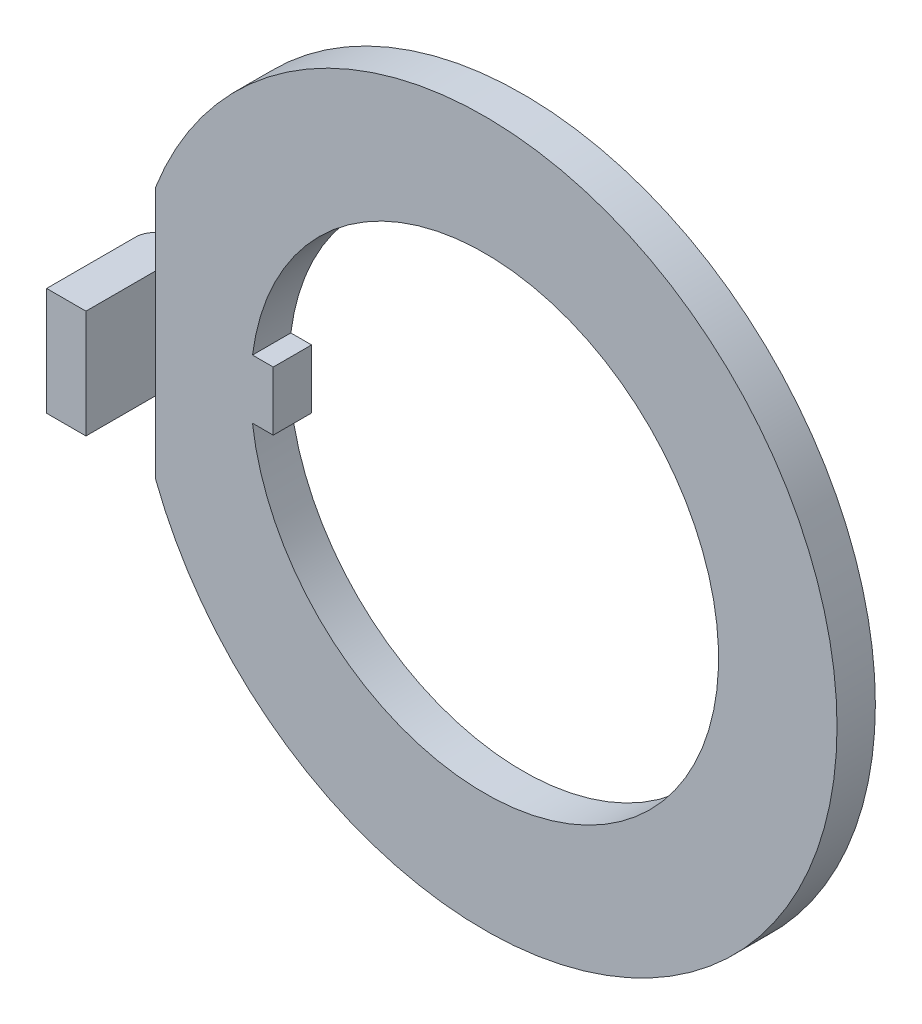
ISO-10303-21;
HEADER;
FILE_DESCRIPTION(('STEP AP214'),'2;1');
FILE_NAME('part.step','',(''),(''),'','','');
FILE_SCHEMA(('AUTOMOTIVE_DESIGN { 1 0 10303 214 1 1 1 1 }'));
ENDSEC;
DATA;
#1=APPLICATION_CONTEXT('core data for automotive mechanical design processes');
#2=APPLICATION_PROTOCOL_DEFINITION('international standard','automotive_design',2000,#1);
#3=PRODUCT_CONTEXT('',#1,'mechanical');
#4=PRODUCT('Part','Part','',(#3));
#5=PRODUCT_RELATED_PRODUCT_CATEGORY('part','',(#4));
#6=PRODUCT_DEFINITION_FORMATION('','',#4);
#7=PRODUCT_DEFINITION_CONTEXT('part definition',#1,'design');
#8=PRODUCT_DEFINITION('design','',#6,#7);
#9=PRODUCT_DEFINITION_SHAPE('','',#8);
#10=(LENGTH_UNIT() NAMED_UNIT(*) SI_UNIT(.MILLI.,.METRE.));
#11=(NAMED_UNIT(*) PLANE_ANGLE_UNIT() SI_UNIT($,.RADIAN.));
#12=(NAMED_UNIT(*) SI_UNIT($,.STERADIAN.) SOLID_ANGLE_UNIT());
#13=UNCERTAINTY_MEASURE_WITH_UNIT(LENGTH_MEASURE(1.E-05),#10,'distance_accuracy_value','');
#14=(GEOMETRIC_REPRESENTATION_CONTEXT(3) GLOBAL_UNCERTAINTY_ASSIGNED_CONTEXT((#13)) GLOBAL_UNIT_ASSIGNED_CONTEXT((#10,
#11,#12)) REPRESENTATION_CONTEXT('',''));
#15=CARTESIAN_POINT('',(0.,0.,0.));
#16=DIRECTION('',(0.,0.,1.));
#17=DIRECTION('',(1.,0.,0.));
#18=AXIS2_PLACEMENT_3D('',#15,#16,#17);
#19=CARTESIAN_POINT('',(-8.4963,3.2757138336552,0.9906));
#20=DIRECTION('',(1.,0.,0.));
#21=DIRECTION('',(0.,0.,-1.));
#22=AXIS2_PLACEMENT_3D('',#19,#20,#21);
#23=PLANE('',#22);
#24=DIRECTION('',(0.,0.,1.));
#25=VECTOR('',#24,1.);
#26=CARTESIAN_POINT('',(-8.4963,-1.397,0.9906));
#27=LINE('',#26,#25);
#28=CARTESIAN_POINT('',(-8.4963,-1.397,0.));
#29=VERTEX_POINT('',#28);
#30=CARTESIAN_POINT('',(-8.4963,-1.397,0.9906));
#31=VERTEX_POINT('',#30);
#32=EDGE_CURVE('E11',#29,#31,#27,.T.);
#33=ORIENTED_EDGE('',*,*,#32,.F.);
#34=DIRECTION('',(0.,-1.,0.));
#35=VECTOR('',#34,1.);
#36=CARTESIAN_POINT('',(-8.4963,3.2757138336552,0.));
#37=LINE('',#36,#35);
#38=CARTESIAN_POINT('',(-8.4963,-3.2757138336552,0.));
#39=VERTEX_POINT('',#38);
#40=EDGE_CURVE('E25',#29,#39,#37,.T.);
#41=ORIENTED_EDGE('',*,*,#40,.T.);
#42=DIRECTION('',(0.,0.,-1.));
#43=VECTOR('',#42,1.);
#44=CARTESIAN_POINT('',(-8.4963,-3.2757138336552,0.9906));
#45=LINE('',#44,#43);
#46=CARTESIAN_POINT('',(-8.4963,-3.2757138336552,0.9906));
#47=VERTEX_POINT('',#46);
#48=EDGE_CURVE('E268',#47,#39,#45,.T.);
#49=ORIENTED_EDGE('',*,*,#48,.F.);
#50=DIRECTION('',(0.,-1.,0.));
#51=VECTOR('',#50,1.);
#52=CARTESIAN_POINT('',(-8.4963,3.2757138336552,0.9906));
#53=LINE('',#52,#51);
#54=EDGE_CURVE('E263',#31,#47,#53,.T.);
#55=ORIENTED_EDGE('',*,*,#54,.F.);
#56=EDGE_LOOP('',(#33,#41,#49,#55));
#57=FACE_BOUND('',#56,.T.);
#58=ADVANCED_FACE('F17',(#57),#23,.F.);
#59=CARTESIAN_POINT('',(0.,0.,0.9906));
#60=DIRECTION('',(0.,0.,1.));
#61=DIRECTION('',(1.,0.,0.));
#62=AXIS2_PLACEMENT_3D('',#59,#60,#61);
#63=PLANE('',#62);
#64=DIRECTION('',(0.,-1.,0.));
#65=VECTOR('',#64,1.);
#66=CARTESIAN_POINT('',(-8.4963,3.2757138336552,0.9906));
#67=LINE('',#66,#65);
#68=CARTESIAN_POINT('',(-8.4963,3.2757138336552,0.9906));
#69=VERTEX_POINT('',#68);
#70=CARTESIAN_POINT('',(-8.4963,1.397,0.9906));
#71=VERTEX_POINT('',#70);
#72=EDGE_CURVE('E259',#69,#71,#67,.T.);
#73=ORIENTED_EDGE('',*,*,#72,.T.);
#74=DIRECTION('',(0.,-1.,0.));
#75=VECTOR('',#74,1.);
#76=CARTESIAN_POINT('',(-8.4963,1.397,0.9906));
#77=LINE('',#76,#75);
#78=EDGE_CURVE('E254',#71,#31,#77,.T.);
#79=ORIENTED_EDGE('',*,*,#78,.T.);
#80=ORIENTED_EDGE('',*,*,#54,.T.);
#81=CARTESIAN_POINT('',(0.,0.,0.9906));
#82=DIRECTION('',(0.,0.,1.));
#83=DIRECTION('',(1.,0.,0.));
#84=AXIS2_PLACEMENT_3D('',#81,#82,#83);
#85=CIRCLE('',#84,9.1059);
#86=EDGE_CURVE('E250',#47,#69,#85,.T.);
#87=ORIENTED_EDGE('',*,*,#86,.T.);
#88=EDGE_LOOP('',(#73,#79,#80,#87));
#89=FACE_BOUND('',#88,.T.);
#90=DIRECTION('',(-1.,0.,0.));
#91=VECTOR('',#90,1.);
#92=CARTESIAN_POINT('',(-5.461,-0.762,0.9906));
#93=LINE('',#92,#91);
#94=CARTESIAN_POINT('',(-5.461,-0.762,0.9906));
#95=VERTEX_POINT('',#94);
#96=CARTESIAN_POINT('',(-5.9969824945551,-0.762,0.9906));
#97=VERTEX_POINT('',#96);
#98=EDGE_CURVE('E245',#95,#97,#93,.T.);
#99=ORIENTED_EDGE('',*,*,#98,.F.);
#100=DIRECTION('',(0.,-1.,0.));
#101=VECTOR('',#100,1.);
#102=CARTESIAN_POINT('',(-5.461,0.762,0.9906));
#103=LINE('',#102,#101);
#104=CARTESIAN_POINT('',(-5.461,0.762,0.9906));
#105=VERTEX_POINT('',#104);
#106=EDGE_CURVE('E240',#105,#95,#103,.T.);
#107=ORIENTED_EDGE('',*,*,#106,.F.);
#108=DIRECTION('',(1.,0.,0.));
#109=VECTOR('',#108,1.);
#110=CARTESIAN_POINT('',(-5.9969824945551,0.762,0.9906));
#111=LINE('',#110,#109);
#112=CARTESIAN_POINT('',(-5.9969824945551,0.762,0.9906));
#113=VERTEX_POINT('',#112);
#114=EDGE_CURVE('E235',#113,#105,#111,.T.);
#115=ORIENTED_EDGE('',*,*,#114,.F.);
#116=CARTESIAN_POINT('',(0.,0.,0.9906));
#117=DIRECTION('',(0.,0.,1.));
#118=DIRECTION('',(1.,0.,0.));
#119=AXIS2_PLACEMENT_3D('',#116,#117,#118);
#120=CIRCLE('',#119,6.0452);
#121=EDGE_CURVE('E230',#97,#113,#120,.T.);
#122=ORIENTED_EDGE('',*,*,#121,.F.);
#123=EDGE_LOOP('',(#99,#107,#115,#122));
#124=FACE_BOUND('',#123,.T.);
#125=ADVANCED_FACE('F287',(#89,#124),#63,.T.);
#126=CARTESIAN_POINT('',(0.,0.,0.9906));
#127=DIRECTION('',(0.,0.,-1.));
#128=DIRECTION('',(-1.,0.,0.));
#129=AXIS2_PLACEMENT_3D('',#126,#127,#128);
#130=CYLINDRICAL_SURFACE('',#129,6.0452);
#131=CARTESIAN_POINT('',(0.,0.,0.));
#132=DIRECTION('',(0.,0.,1.));
#133=DIRECTION('',(1.,0.,0.));
#134=AXIS2_PLACEMENT_3D('',#131,#132,#133);
#135=CIRCLE('',#134,6.0452);
#136=CARTESIAN_POINT('',(-5.9969824945551,-0.762,0.));
#137=VERTEX_POINT('',#136);
#138=CARTESIAN_POINT('',(-5.9969824945551,0.762,0.));
#139=VERTEX_POINT('',#138);
#140=EDGE_CURVE('E225',#137,#139,#135,.T.);
#141=ORIENTED_EDGE('',*,*,#140,.F.);
#142=DIRECTION('',(0.,0.,-1.));
#143=VECTOR('',#142,1.);
#144=CARTESIAN_POINT('',(-5.9969824945551,-0.762,0.9906));
#145=LINE('',#144,#143);
#146=EDGE_CURVE('E220',#97,#137,#145,.T.);
#147=ORIENTED_EDGE('',*,*,#146,.F.);
#148=ORIENTED_EDGE('',*,*,#121,.T.);
#149=DIRECTION('',(0.,0.,-1.));
#150=VECTOR('',#149,1.);
#151=CARTESIAN_POINT('',(-5.9969824945551,0.762,0.9906));
#152=LINE('',#151,#150);
#153=EDGE_CURVE('E216',#113,#139,#152,.T.);
#154=ORIENTED_EDGE('',*,*,#153,.T.);
#155=EDGE_LOOP('',(#141,#147,#148,#154));
#156=FACE_BOUND('',#155,.T.);
#157=ADVANCED_FACE('F314',(#156),#130,.F.);
#158=CARTESIAN_POINT('',(-5.9969824945551,0.762,0.9906));
#159=DIRECTION('',(0.,1.,0.));
#160=DIRECTION('',(0.,0.,1.));
#161=AXIS2_PLACEMENT_3D('',#158,#159,#160);
#162=PLANE('',#161);
#163=DIRECTION('',(1.,0.,0.));
#164=VECTOR('',#163,1.);
#165=CARTESIAN_POINT('',(-5.9969824945551,0.762,0.));
#166=LINE('',#165,#164);
#167=CARTESIAN_POINT('',(-5.461,0.762,0.));
#168=VERTEX_POINT('',#167);
#169=EDGE_CURVE('E211',#139,#168,#166,.T.);
#170=ORIENTED_EDGE('',*,*,#169,.F.);
#171=ORIENTED_EDGE('',*,*,#153,.F.);
#172=ORIENTED_EDGE('',*,*,#114,.T.);
#173=DIRECTION('',(0.,0.,-1.));
#174=VECTOR('',#173,1.);
#175=CARTESIAN_POINT('',(-5.461,0.762,0.9906));
#176=LINE('',#175,#174);
#177=EDGE_CURVE('E207',#105,#168,#176,.T.);
#178=ORIENTED_EDGE('',*,*,#177,.T.);
#179=EDGE_LOOP('',(#170,#171,#172,#178));
#180=FACE_BOUND('',#179,.T.);
#181=ADVANCED_FACE('F318',(#180),#162,.T.);
#182=CARTESIAN_POINT('',(-5.461,0.762,0.9906));
#183=DIRECTION('',(1.,0.,0.));
#184=DIRECTION('',(0.,0.,-1.));
#185=AXIS2_PLACEMENT_3D('',#182,#183,#184);
#186=PLANE('',#185);
#187=DIRECTION('',(0.,-1.,0.));
#188=VECTOR('',#187,1.);
#189=CARTESIAN_POINT('',(-5.461,0.762,0.));
#190=LINE('',#189,#188);
#191=CARTESIAN_POINT('',(-5.461,-0.762,0.));
#192=VERTEX_POINT('',#191);
#193=EDGE_CURVE('E202',#168,#192,#190,.T.);
#194=ORIENTED_EDGE('',*,*,#193,.F.);
#195=ORIENTED_EDGE('',*,*,#177,.F.);
#196=ORIENTED_EDGE('',*,*,#106,.T.);
#197=DIRECTION('',(0.,0.,-1.));
#198=VECTOR('',#197,1.);
#199=CARTESIAN_POINT('',(-5.461,-0.762,0.9906));
#200=LINE('',#199,#198);
#201=EDGE_CURVE('E198',#95,#192,#200,.T.);
#202=ORIENTED_EDGE('',*,*,#201,.T.);
#203=EDGE_LOOP('',(#194,#195,#196,#202));
#204=FACE_BOUND('',#203,.T.);
#205=ADVANCED_FACE('F324',(#204),#186,.T.);
#206=CARTESIAN_POINT('',(-5.461,-0.762,0.9906));
#207=DIRECTION('',(0.,-1.,0.));
#208=DIRECTION('',(0.,0.,-1.));
#209=AXIS2_PLACEMENT_3D('',#206,#207,#208);
#210=PLANE('',#209);
#211=DIRECTION('',(-1.,0.,0.));
#212=VECTOR('',#211,1.);
#213=CARTESIAN_POINT('',(-5.461,-0.762,0.));
#214=LINE('',#213,#212);
#215=EDGE_CURVE('E193',#192,#137,#214,.T.);
#216=ORIENTED_EDGE('',*,*,#215,.F.);
#217=ORIENTED_EDGE('',*,*,#201,.F.);
#218=ORIENTED_EDGE('',*,*,#98,.T.);
#219=ORIENTED_EDGE('',*,*,#146,.T.);
#220=EDGE_LOOP('',(#216,#217,#218,#219));
#221=FACE_BOUND('',#220,.T.);
#222=ADVANCED_FACE('F328',(#221),#210,.T.);
#223=CARTESIAN_POINT('',(0.,0.,0.));
#224=DIRECTION('',(0.,0.,1.));
#225=DIRECTION('',(1.,0.,0.));
#226=AXIS2_PLACEMENT_3D('',#223,#224,#225);
#227=PLANE('',#226);
#228=ORIENTED_EDGE('',*,*,#40,.F.);
#229=DIRECTION('',(-1.,0.,0.));
#230=VECTOR('',#229,1.);
#231=CARTESIAN_POINT('',(-6.0833,-1.397,0.));
#232=LINE('',#231,#230);
#233=CARTESIAN_POINT('',(-9.017,-1.397,0.));
#234=VERTEX_POINT('',#233);
#235=EDGE_CURVE('E189',#29,#234,#232,.T.);
#236=ORIENTED_EDGE('',*,*,#235,.T.);
#237=DIRECTION('',(0.,-1.,0.));
#238=VECTOR('',#237,1.);
#239=CARTESIAN_POINT('',(-9.017,1.397,0.));
#240=LINE('',#239,#238);
#241=CARTESIAN_POINT('',(-9.017,1.397,0.));
#242=VERTEX_POINT('',#241);
#243=EDGE_CURVE('E118',#242,#234,#240,.T.);
#244=ORIENTED_EDGE('',*,*,#243,.F.);
#245=DIRECTION('',(-1.,0.,0.));
#246=VECTOR('',#245,1.);
#247=CARTESIAN_POINT('',(-6.0833,1.397,0.));
#248=LINE('',#247,#246);
#249=CARTESIAN_POINT('',(-8.4963,1.397,0.));
#250=VERTEX_POINT('',#249);
#251=EDGE_CURVE('E181',#250,#242,#248,.T.);
#252=ORIENTED_EDGE('',*,*,#251,.F.);
#253=DIRECTION('',(0.,-1.,0.));
#254=VECTOR('',#253,1.);
#255=CARTESIAN_POINT('',(-8.4963,3.2757138336552,0.));
#256=LINE('',#255,#254);
#257=CARTESIAN_POINT('',(-8.4963,3.2757138336552,0.));
#258=VERTEX_POINT('',#257);
#259=EDGE_CURVE('E176',#258,#250,#256,.T.);
#260=ORIENTED_EDGE('',*,*,#259,.F.);
#261=CARTESIAN_POINT('',(0.,0.,0.));
#262=DIRECTION('',(0.,0.,1.));
#263=DIRECTION('',(1.,0.,0.));
#264=AXIS2_PLACEMENT_3D('',#261,#262,#263);
#265=CIRCLE('',#264,9.1059);
#266=EDGE_CURVE('E171',#39,#258,#265,.T.);
#267=ORIENTED_EDGE('',*,*,#266,.F.);
#268=EDGE_LOOP('',(#228,#236,#244,#252,#260,#267));
#269=FACE_BOUND('',#268,.T.);
#270=ORIENTED_EDGE('',*,*,#215,.T.);
#271=ORIENTED_EDGE('',*,*,#140,.T.);
#272=ORIENTED_EDGE('',*,*,#169,.T.);
#273=ORIENTED_EDGE('',*,*,#193,.T.);
#274=EDGE_LOOP('',(#270,#271,#272,#273));
#275=FACE_BOUND('',#274,.T.);
#276=ADVANCED_FACE('F291',(#269,#275),#227,.F.);
#277=CARTESIAN_POINT('',(0.,0.,0.9906));
#278=DIRECTION('',(0.,0.,-1.));
#279=DIRECTION('',(-1.,0.,0.));
#280=AXIS2_PLACEMENT_3D('',#277,#278,#279);
#281=CYLINDRICAL_SURFACE('',#280,9.1059);
#282=ORIENTED_EDGE('',*,*,#266,.T.);
#283=DIRECTION('',(0.,0.,-1.));
#284=VECTOR('',#283,1.);
#285=CARTESIAN_POINT('',(-8.4963,3.2757138336552,0.9906));
#286=LINE('',#285,#284);
#287=EDGE_CURVE('E166',#69,#258,#286,.T.);
#288=ORIENTED_EDGE('',*,*,#287,.F.);
#289=ORIENTED_EDGE('',*,*,#86,.F.);
#290=ORIENTED_EDGE('',*,*,#48,.T.);
#291=EDGE_LOOP('',(#282,#288,#289,#290));
#292=FACE_BOUND('',#291,.T.);
#293=ADVANCED_FACE('F279',(#292),#281,.T.);
#294=CARTESIAN_POINT('',(-8.4963,3.2757138336552,0.9906));
#295=DIRECTION('',(1.,0.,0.));
#296=DIRECTION('',(0.,0.,-1.));
#297=AXIS2_PLACEMENT_3D('',#294,#295,#296);
#298=PLANE('',#297);
#299=ORIENTED_EDGE('',*,*,#259,.T.);
#300=DIRECTION('',(0.,0.,1.));
#301=VECTOR('',#300,1.);
#302=CARTESIAN_POINT('',(-8.4963,1.397,0.9906));
#303=LINE('',#302,#301);
#304=EDGE_CURVE('E161',#250,#71,#303,.T.);
#305=ORIENTED_EDGE('',*,*,#304,.T.);
#306=ORIENTED_EDGE('',*,*,#72,.F.);
#307=ORIENTED_EDGE('',*,*,#287,.T.);
#308=EDGE_LOOP('',(#299,#305,#306,#307));
#309=FACE_BOUND('',#308,.T.);
#310=ADVANCED_FACE('F295',(#309),#298,.F.);
#311=CARTESIAN_POINT('',(-9.017,1.397,0.495299999999991));
#312=DIRECTION('',(0.,1.,0.));
#313=DIRECTION('',(0.,0.,1.));
#314=AXIS2_PLACEMENT_3D('',#311,#312,#313);
#315=PLANE('',#314);
#316=ORIENTED_EDGE('',*,*,#304,.F.);
#317=ORIENTED_EDGE('',*,*,#251,.T.);
#318=CARTESIAN_POINT('',(-9.017,1.397,0.495299999999991));
#319=DIRECTION('',(0.,1.,0.));
#320=DIRECTION('',(1.,0.,0.));
#321=AXIS2_PLACEMENT_3D('',#318,#319,#320);
#322=CIRCLE('',#321,0.495299999999991);
#323=CARTESIAN_POINT('',(-9.5123,1.397,0.4953));
#324=VERTEX_POINT('',#323);
#325=EDGE_CURVE('E157',#242,#324,#322,.T.);
#326=ORIENTED_EDGE('',*,*,#325,.T.);
#327=DIRECTION('',(0.,0.,1.));
#328=VECTOR('',#327,1.);
#329=CARTESIAN_POINT('',(-9.5123,1.397,0.4953));
#330=LINE('',#329,#328);
#331=CARTESIAN_POINT('',(-9.5123,1.397,2.794));
#332=VERTEX_POINT('',#331);
#333=EDGE_CURVE('E110',#324,#332,#330,.T.);
#334=ORIENTED_EDGE('',*,*,#333,.T.);
#335=DIRECTION('',(1.,0.,0.));
#336=VECTOR('',#335,1.);
#337=CARTESIAN_POINT('',(-9.5123,1.397,2.794));
#338=LINE('',#337,#336);
#339=CARTESIAN_POINT('',(-8.4963,1.397,2.794));
#340=VERTEX_POINT('',#339);
#341=EDGE_CURVE('E150',#332,#340,#338,.T.);
#342=ORIENTED_EDGE('',*,*,#341,.T.);
#343=DIRECTION('',(0.,0.,-1.));
#344=VECTOR('',#343,1.);
#345=CARTESIAN_POINT('',(-8.4963,1.397,2.794));
#346=LINE('',#345,#344);
#347=EDGE_CURVE('E145',#340,#71,#346,.T.);
#348=ORIENTED_EDGE('',*,*,#347,.T.);
#349=EDGE_LOOP('',(#316,#317,#326,#334,#342,#348));
#350=FACE_BOUND('',#349,.T.);
#351=ADVANCED_FACE('F297',(#350),#315,.T.);
#352=CARTESIAN_POINT('',(-8.4963,1.397,2.794));
#353=DIRECTION('',(-1.,0.,0.));
#354=DIRECTION('',(0.,0.,1.));
#355=AXIS2_PLACEMENT_3D('',#352,#353,#354);
#356=PLANE('',#355);
#357=DIRECTION('',(0.,0.,-1.));
#358=VECTOR('',#357,1.);
#359=CARTESIAN_POINT('',(-8.4963,-1.397,2.794));
#360=LINE('',#359,#358);
#361=CARTESIAN_POINT('',(-8.4963,-1.397,2.794));
#362=VERTEX_POINT('',#361);
#363=EDGE_CURVE('E140',#362,#31,#360,.T.);
#364=ORIENTED_EDGE('',*,*,#363,.T.);
#365=ORIENTED_EDGE('',*,*,#78,.F.);
#366=ORIENTED_EDGE('',*,*,#347,.F.);
#367=DIRECTION('',(0.,-1.,0.));
#368=VECTOR('',#367,1.);
#369=CARTESIAN_POINT('',(-8.4963,1.397,2.794));
#370=LINE('',#369,#368);
#371=EDGE_CURVE('E136',#340,#362,#370,.T.);
#372=ORIENTED_EDGE('',*,*,#371,.T.);
#373=EDGE_LOOP('',(#364,#365,#366,#372));
#374=FACE_BOUND('',#373,.T.);
#375=ADVANCED_FACE('F284',(#374),#356,.F.);
#376=CARTESIAN_POINT('',(-9.5123,1.397,2.794));
#377=DIRECTION('',(0.,0.,-1.));
#378=DIRECTION('',(-1.,0.,0.));
#379=AXIS2_PLACEMENT_3D('',#376,#377,#378);
#380=PLANE('',#379);
#381=DIRECTION('',(1.,0.,0.));
#382=VECTOR('',#381,1.);
#383=CARTESIAN_POINT('',(-9.5123,-1.397,2.794));
#384=LINE('',#383,#382);
#385=CARTESIAN_POINT('',(-9.5123,-1.397,2.794));
#386=VERTEX_POINT('',#385);
#387=EDGE_CURVE('E124',#386,#362,#384,.T.);
#388=ORIENTED_EDGE('',*,*,#387,.T.);
#389=ORIENTED_EDGE('',*,*,#371,.F.);
#390=ORIENTED_EDGE('',*,*,#341,.F.);
#391=DIRECTION('',(0.,-1.,0.));
#392=VECTOR('',#391,1.);
#393=CARTESIAN_POINT('',(-9.5123,1.397,2.794));
#394=LINE('',#393,#392);
#395=EDGE_CURVE('E125',#332,#386,#394,.T.);
#396=ORIENTED_EDGE('',*,*,#395,.T.);
#397=EDGE_LOOP('',(#388,#389,#390,#396));
#398=FACE_BOUND('',#397,.T.);
#399=ADVANCED_FACE('F300',(#398),#380,.F.);
#400=CARTESIAN_POINT('',(-9.5123,1.397,0.4953));
#401=DIRECTION('',(1.,0.,0.));
#402=DIRECTION('',(0.,0.,-1.));
#403=AXIS2_PLACEMENT_3D('',#400,#401,#402);
#404=PLANE('',#403);
#405=DIRECTION('',(0.,0.,1.));
#406=VECTOR('',#405,1.);
#407=CARTESIAN_POINT('',(-9.5123,-1.397,0.4953));
#408=LINE('',#407,#406);
#409=CARTESIAN_POINT('',(-9.5123,-1.397,0.4953));
#410=VERTEX_POINT('',#409);
#411=EDGE_CURVE('E108',#410,#386,#408,.T.);
#412=ORIENTED_EDGE('',*,*,#411,.T.);
#413=ORIENTED_EDGE('',*,*,#395,.F.);
#414=ORIENTED_EDGE('',*,*,#333,.F.);
#415=DIRECTION('',(0.,-1.,0.));
#416=VECTOR('',#415,1.);
#417=CARTESIAN_POINT('',(-9.5123,1.397,0.4953));
#418=LINE('',#417,#416);
#419=EDGE_CURVE('E103',#324,#410,#418,.T.);
#420=ORIENTED_EDGE('',*,*,#419,.T.);
#421=EDGE_LOOP('',(#412,#413,#414,#420));
#422=FACE_BOUND('',#421,.T.);
#423=ADVANCED_FACE('F105',(#422),#404,.F.);
#424=CARTESIAN_POINT('',(-9.017,1.397,0.495299999999991));
#425=DIRECTION('',(0.,-1.,0.));
#426=DIRECTION('',(0.707106781186554,0.,0.707106781186541));
#427=AXIS2_PLACEMENT_3D('',#424,#425,#426);
#428=CYLINDRICAL_SURFACE('',#427,0.495299999999991);
#429=CARTESIAN_POINT('',(-9.017,-1.397,0.495299999999991));
#430=DIRECTION('',(0.,1.,0.));
#431=DIRECTION('',(1.,0.,0.));
#432=AXIS2_PLACEMENT_3D('',#429,#430,#431);
#433=CIRCLE('',#432,0.495299999999991);
#434=EDGE_CURVE('E113',#234,#410,#433,.T.);
#435=ORIENTED_EDGE('',*,*,#434,.T.);
#436=ORIENTED_EDGE('',*,*,#419,.F.);
#437=ORIENTED_EDGE('',*,*,#325,.F.);
#438=ORIENTED_EDGE('',*,*,#243,.T.);
#439=EDGE_LOOP('',(#435,#436,#437,#438));
#440=FACE_BOUND('',#439,.T.);
#441=ADVANCED_FACE('F117',(#440),#428,.T.);
#442=CARTESIAN_POINT('',(-9.017,-1.397,0.495299999999991));
#443=DIRECTION('',(0.,1.,0.));
#444=DIRECTION('',(0.,0.,1.));
#445=AXIS2_PLACEMENT_3D('',#442,#443,#444);
#446=PLANE('',#445);
#447=ORIENTED_EDGE('',*,*,#235,.F.);
#448=ORIENTED_EDGE('',*,*,#32,.T.);
#449=ORIENTED_EDGE('',*,*,#363,.F.);
#450=ORIENTED_EDGE('',*,*,#387,.F.);
#451=ORIENTED_EDGE('',*,*,#411,.F.);
#452=ORIENTED_EDGE('',*,*,#434,.F.);
#453=EDGE_LOOP('',(#447,#448,#449,#450,#451,#452));
#454=FACE_BOUND('',#453,.T.);
#455=ADVANCED_FACE('F121',(#454),#446,.F.);
#456=CLOSED_SHELL('',(#58,#125,#157,#181,#205,#222,#276,#293,#310,#351,#375,#399,#423,#441,#455));
#457=MANIFOLD_SOLID_BREP('B1',#456);
#458=ADVANCED_BREP_SHAPE_REPRESENTATION('',(#18,#457),#14);
#459=SHAPE_DEFINITION_REPRESENTATION(#9,#458);
ENDSEC;
END-ISO-10303-21;
